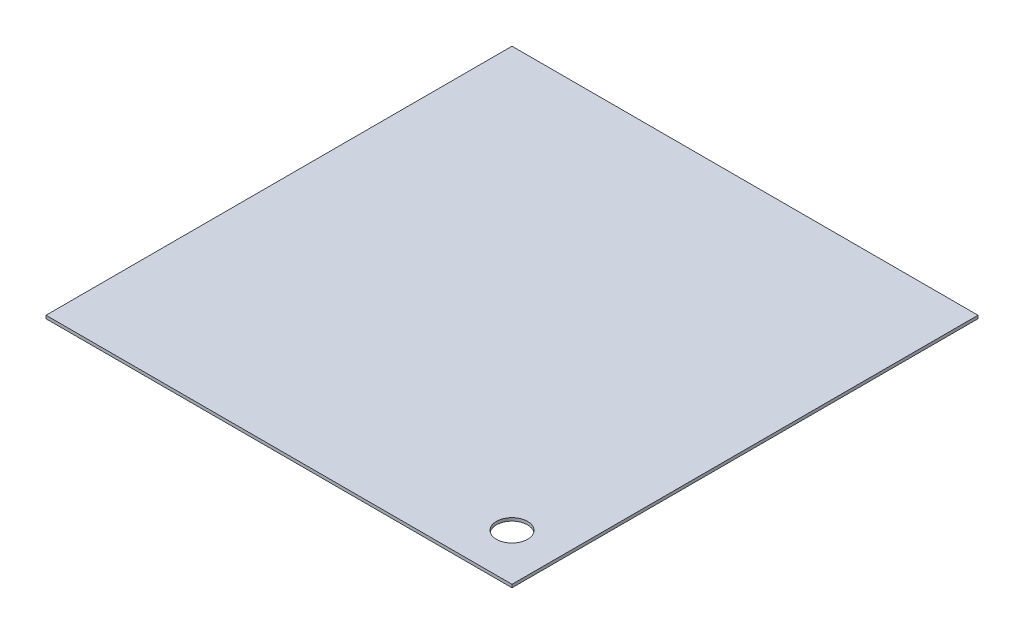
ISO-10303-21;
HEADER;
FILE_DESCRIPTION(('STEP AP214'),'2;1');
FILE_NAME('part.step','',(''),(''),'','','');
FILE_SCHEMA(('AUTOMOTIVE_DESIGN { 1 0 10303 214 1 1 1 1 }'));
ENDSEC;
DATA;
#1=APPLICATION_CONTEXT('core data for automotive mechanical design processes');
#2=APPLICATION_PROTOCOL_DEFINITION('international standard','automotive_design',2000,#1);
#3=PRODUCT_CONTEXT('',#1,'mechanical');
#4=PRODUCT('Part','Part','',(#3));
#5=PRODUCT_RELATED_PRODUCT_CATEGORY('part','',(#4));
#6=PRODUCT_DEFINITION_FORMATION('','',#4);
#7=PRODUCT_DEFINITION_CONTEXT('part definition',#1,'design');
#8=PRODUCT_DEFINITION('design','',#6,#7);
#9=PRODUCT_DEFINITION_SHAPE('','',#8);
#10=(LENGTH_UNIT() NAMED_UNIT(*) SI_UNIT(.MILLI.,.METRE.));
#11=(NAMED_UNIT(*) PLANE_ANGLE_UNIT() SI_UNIT($,.RADIAN.));
#12=(NAMED_UNIT(*) SI_UNIT($,.STERADIAN.) SOLID_ANGLE_UNIT());
#13=UNCERTAINTY_MEASURE_WITH_UNIT(LENGTH_MEASURE(1.E-05),#10,'distance_accuracy_value','');
#14=(GEOMETRIC_REPRESENTATION_CONTEXT(3) GLOBAL_UNCERTAINTY_ASSIGNED_CONTEXT((#13)) GLOBAL_UNIT_ASSIGNED_CONTEXT((#10,
#11,#12)) REPRESENTATION_CONTEXT('',''));
#15=CARTESIAN_POINT('',(0.,0.,0.));
#16=DIRECTION('',(0.,0.,1.));
#17=DIRECTION('',(1.,0.,0.));
#18=AXIS2_PLACEMENT_3D('',#15,#16,#17);
#19=CARTESIAN_POINT('',(190.0428,2.5,190.0428));
#20=DIRECTION('',(-1.,0.,0.));
#21=DIRECTION('',(0.,0.,1.));
#22=AXIS2_PLACEMENT_3D('',#19,#20,#21);
#23=PLANE('',#22);
#24=DIRECTION('',(0.,0.,-1.));
#25=VECTOR('',#24,1.);
#26=CARTESIAN_POINT('',(190.0428,0.,190.0428));
#27=LINE('',#26,#25);
#28=CARTESIAN_POINT('',(190.0428,0.,190.0428));
#29=VERTEX_POINT('',#28);
#30=CARTESIAN_POINT('',(190.0428,0.,-190.0428));
#31=VERTEX_POINT('',#30);
#32=EDGE_CURVE('E106',#29,#31,#27,.T.);
#33=ORIENTED_EDGE('',*,*,#32,.T.);
#34=DIRECTION('',(0.,-1.,0.));
#35=VECTOR('',#34,1.);
#36=CARTESIAN_POINT('',(190.0428,2.5,-190.0428));
#37=LINE('',#36,#35);
#38=CARTESIAN_POINT('',(190.0428,2.5,-190.0428));
#39=VERTEX_POINT('',#38);
#40=EDGE_CURVE('E11',#39,#31,#37,.T.);
#41=ORIENTED_EDGE('',*,*,#40,.F.);
#42=DIRECTION('',(0.,0.,-1.));
#43=VECTOR('',#42,1.);
#44=CARTESIAN_POINT('',(190.0428,2.5,190.0428));
#45=LINE('',#44,#43);
#46=CARTESIAN_POINT('',(190.0428,2.5,190.0428));
#47=VERTEX_POINT('',#46);
#48=EDGE_CURVE('E90',#47,#39,#45,.T.);
#49=ORIENTED_EDGE('',*,*,#48,.F.);
#50=DIRECTION('',(0.,-1.,0.));
#51=VECTOR('',#50,1.);
#52=CARTESIAN_POINT('',(190.0428,2.5,190.0428));
#53=LINE('',#52,#51);
#54=EDGE_CURVE('E102',#47,#29,#53,.T.);
#55=ORIENTED_EDGE('',*,*,#54,.T.);
#56=EDGE_LOOP('',(#33,#41,#49,#55));
#57=FACE_BOUND('',#56,.T.);
#58=ADVANCED_FACE('F38',(#57),#23,.F.);
#59=CARTESIAN_POINT('',(-190.0428,2.5,-190.0428));
#60=DIRECTION('',(0.,0.,1.));
#61=DIRECTION('',(1.,0.,0.));
#62=AXIS2_PLACEMENT_3D('',#59,#60,#61);
#63=PLANE('',#62);
#64=DIRECTION('',(-1.,0.,0.));
#65=VECTOR('',#64,1.);
#66=CARTESIAN_POINT('',(-190.0428,0.,-190.0428));
#67=LINE('',#66,#65);
#68=CARTESIAN_POINT('',(-190.0428,0.,-190.0428));
#69=VERTEX_POINT('',#68);
#70=EDGE_CURVE('E95',#31,#69,#67,.T.);
#71=ORIENTED_EDGE('',*,*,#70,.T.);
#72=DIRECTION('',(0.,-1.,0.));
#73=VECTOR('',#72,1.);
#74=CARTESIAN_POINT('',(-190.0428,2.5,-190.0428));
#75=LINE('',#74,#73);
#76=CARTESIAN_POINT('',(-190.0428,2.5,-190.0428));
#77=VERTEX_POINT('',#76);
#78=EDGE_CURVE('E47',#77,#69,#75,.T.);
#79=ORIENTED_EDGE('',*,*,#78,.F.);
#80=DIRECTION('',(-1.,0.,0.));
#81=VECTOR('',#80,1.);
#82=CARTESIAN_POINT('',(-190.0428,2.5,-190.0428));
#83=LINE('',#82,#81);
#84=EDGE_CURVE('E85',#39,#77,#83,.T.);
#85=ORIENTED_EDGE('',*,*,#84,.F.);
#86=ORIENTED_EDGE('',*,*,#40,.T.);
#87=EDGE_LOOP('',(#71,#79,#85,#86));
#88=FACE_BOUND('',#87,.T.);
#89=ADVANCED_FACE('F94',(#88),#63,.F.);
#90=CARTESIAN_POINT('',(-190.0428,2.5,190.0428));
#91=DIRECTION('',(1.,0.,0.));
#92=DIRECTION('',(0.,0.,-1.));
#93=AXIS2_PLACEMENT_3D('',#90,#91,#92);
#94=PLANE('',#93);
#95=DIRECTION('',(0.,0.,1.));
#96=VECTOR('',#95,1.);
#97=CARTESIAN_POINT('',(-190.0428,0.,190.0428));
#98=LINE('',#97,#96);
#99=CARTESIAN_POINT('',(-190.0428,0.,190.0428));
#100=VERTEX_POINT('',#99);
#101=EDGE_CURVE('E72',#69,#100,#98,.T.);
#102=ORIENTED_EDGE('',*,*,#101,.T.);
#103=DIRECTION('',(0.,-1.,0.));
#104=VECTOR('',#103,1.);
#105=CARTESIAN_POINT('',(-190.0428,2.5,190.0428));
#106=LINE('',#105,#104);
#107=CARTESIAN_POINT('',(-190.0428,2.5,190.0428));
#108=VERTEX_POINT('',#107);
#109=EDGE_CURVE('E97',#108,#100,#106,.T.);
#110=ORIENTED_EDGE('',*,*,#109,.F.);
#111=DIRECTION('',(0.,0.,1.));
#112=VECTOR('',#111,1.);
#113=CARTESIAN_POINT('',(-190.0428,2.5,190.0428));
#114=LINE('',#113,#112);
#115=EDGE_CURVE('E88',#77,#108,#114,.T.);
#116=ORIENTED_EDGE('',*,*,#115,.F.);
#117=ORIENTED_EDGE('',*,*,#78,.T.);
#118=EDGE_LOOP('',(#102,#110,#116,#117));
#119=FACE_BOUND('',#118,.T.);
#120=ADVANCED_FACE('F98',(#119),#94,.F.);
#121=CARTESIAN_POINT('',(-190.0428,2.5,190.0428));
#122=DIRECTION('',(0.,0.,-1.));
#123=DIRECTION('',(-1.,0.,0.));
#124=AXIS2_PLACEMENT_3D('',#121,#122,#123);
#125=PLANE('',#124);
#126=DIRECTION('',(1.,0.,0.));
#127=VECTOR('',#126,1.);
#128=CARTESIAN_POINT('',(-190.0428,0.,190.0428));
#129=LINE('',#128,#127);
#130=EDGE_CURVE('E78',#100,#29,#129,.T.);
#131=ORIENTED_EDGE('',*,*,#130,.T.);
#132=ORIENTED_EDGE('',*,*,#54,.F.);
#133=DIRECTION('',(1.,0.,0.));
#134=VECTOR('',#133,1.);
#135=CARTESIAN_POINT('',(-190.0428,2.5,190.0428));
#136=LINE('',#135,#134);
#137=EDGE_CURVE('E55',#108,#47,#136,.T.);
#138=ORIENTED_EDGE('',*,*,#137,.F.);
#139=ORIENTED_EDGE('',*,*,#109,.T.);
#140=EDGE_LOOP('',(#131,#132,#138,#139));
#141=FACE_BOUND('',#140,.T.);
#142=ADVANCED_FACE('F120',(#141),#125,.F.);
#143=CARTESIAN_POINT('',(0.,2.5,0.));
#144=DIRECTION('',(0.,-1.,0.));
#145=DIRECTION('',(0.,0.,-1.));
#146=AXIS2_PLACEMENT_3D('',#143,#144,#145);
#147=PLANE('',#146);
#148=CARTESIAN_POINT('',(151.9428,2.5,151.9428));
#149=DIRECTION('',(0.,1.,0.));
#150=DIRECTION('',(0.,0.,1.));
#151=AXIS2_PLACEMENT_3D('',#148,#149,#150);
#152=CIRCLE('',#151,12.7);
#153=CARTESIAN_POINT('',(151.9428,2.5,164.6428));
#154=VERTEX_POINT('',#153);
#155=EDGE_CURVE('E127',#154,#154,#152,.T.);
#156=ORIENTED_EDGE('',*,*,#155,.F.);
#157=EDGE_LOOP('',(#156));
#158=FACE_BOUND('',#157,.T.);
#159=ORIENTED_EDGE('',*,*,#48,.T.);
#160=ORIENTED_EDGE('',*,*,#84,.T.);
#161=ORIENTED_EDGE('',*,*,#115,.T.);
#162=ORIENTED_EDGE('',*,*,#137,.T.);
#163=EDGE_LOOP('',(#159,#160,#161,#162));
#164=FACE_BOUND('',#163,.T.);
#165=ADVANCED_FACE('F86',(#158,#164),#147,.F.);
#166=CARTESIAN_POINT('',(0.,0.,0.));
#167=DIRECTION('',(0.,-1.,0.));
#168=DIRECTION('',(0.,0.,-1.));
#169=AXIS2_PLACEMENT_3D('',#166,#167,#168);
#170=PLANE('',#169);
#171=CARTESIAN_POINT('',(151.9428,0.,151.9428));
#172=DIRECTION('',(0.,1.,0.));
#173=DIRECTION('',(0.,0.,1.));
#174=AXIS2_PLACEMENT_3D('',#171,#172,#173);
#175=CIRCLE('',#174,12.7);
#176=CARTESIAN_POINT('',(151.9428,0.,164.6428));
#177=VERTEX_POINT('',#176);
#178=EDGE_CURVE('E110',#177,#177,#175,.T.);
#179=ORIENTED_EDGE('',*,*,#178,.T.);
#180=EDGE_LOOP('',(#179));
#181=FACE_BOUND('',#180,.T.);
#182=ORIENTED_EDGE('',*,*,#32,.F.);
#183=ORIENTED_EDGE('',*,*,#130,.F.);
#184=ORIENTED_EDGE('',*,*,#101,.F.);
#185=ORIENTED_EDGE('',*,*,#70,.F.);
#186=EDGE_LOOP('',(#182,#183,#184,#185));
#187=FACE_BOUND('',#186,.T.);
#188=ADVANCED_FACE('F123',(#181,#187),#170,.T.);
#189=CARTESIAN_POINT('',(151.9428,0.,151.9428));
#190=DIRECTION('',(0.,1.,0.));
#191=DIRECTION('',(0.,0.,1.));
#192=AXIS2_PLACEMENT_3D('',#189,#190,#191);
#193=CYLINDRICAL_SURFACE('',#192,12.7);
#194=ORIENTED_EDGE('',*,*,#178,.F.);
#195=EDGE_LOOP('',(#194));
#196=FACE_BOUND('',#195,.T.);
#197=ORIENTED_EDGE('',*,*,#155,.T.);
#198=EDGE_LOOP('',(#197));
#199=FACE_BOUND('',#198,.T.);
#200=ADVANCED_FACE('F136',(#196,#199),#193,.F.);
#201=CLOSED_SHELL('',(#58,#89,#120,#142,#165,#188,#200));
#202=MANIFOLD_SOLID_BREP('B2',#201);
#203=ADVANCED_BREP_SHAPE_REPRESENTATION('',(#18,#202),#14);
#204=SHAPE_DEFINITION_REPRESENTATION(#9,#203);
ENDSEC;
END-ISO-10303-21;
